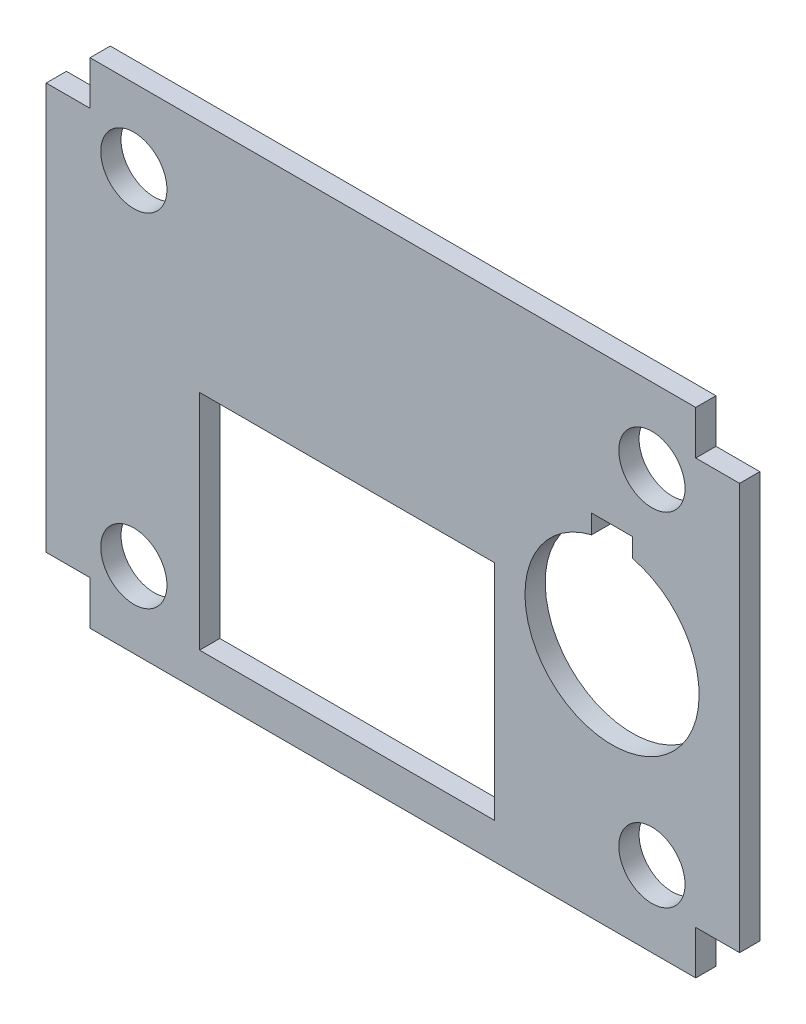
ISO-10303-21;
HEADER;
FILE_DESCRIPTION(('STEP AP214'),'2;1');
FILE_NAME('part.step','',(''),(''),'','','');
FILE_SCHEMA(('AUTOMOTIVE_DESIGN { 1 0 10303 214 1 1 1 1 }'));
ENDSEC;
DATA;
#1=APPLICATION_CONTEXT('core data for automotive mechanical design processes');
#2=APPLICATION_PROTOCOL_DEFINITION('international standard','automotive_design',2000,#1);
#3=PRODUCT_CONTEXT('',#1,'mechanical');
#4=PRODUCT('Part','Part','',(#3));
#5=PRODUCT_RELATED_PRODUCT_CATEGORY('part','',(#4));
#6=PRODUCT_DEFINITION_FORMATION('','',#4);
#7=PRODUCT_DEFINITION_CONTEXT('part definition',#1,'design');
#8=PRODUCT_DEFINITION('design','',#6,#7);
#9=PRODUCT_DEFINITION_SHAPE('','',#8);
#10=(LENGTH_UNIT() NAMED_UNIT(*) SI_UNIT(.MILLI.,.METRE.));
#11=(NAMED_UNIT(*) PLANE_ANGLE_UNIT() SI_UNIT($,.RADIAN.));
#12=(NAMED_UNIT(*) SI_UNIT($,.STERADIAN.) SOLID_ANGLE_UNIT());
#13=UNCERTAINTY_MEASURE_WITH_UNIT(LENGTH_MEASURE(1.E-05),#10,'distance_accuracy_value','');
#14=(GEOMETRIC_REPRESENTATION_CONTEXT(3) GLOBAL_UNCERTAINTY_ASSIGNED_CONTEXT((#13)) GLOBAL_UNIT_ASSIGNED_CONTEXT((#10,
#11,#12)) REPRESENTATION_CONTEXT('',''));
#15=CARTESIAN_POINT('',(0.,0.,0.));
#16=DIRECTION('',(0.,0.,1.));
#17=DIRECTION('',(1.,0.,0.));
#18=AXIS2_PLACEMENT_3D('',#15,#16,#17);
#19=CARTESIAN_POINT('',(-20.5105,14.1605,1.29032));
#20=DIRECTION('',(0.,0.,1.));
#21=DIRECTION('',(1.,0.,0.));
#22=AXIS2_PLACEMENT_3D('',#19,#20,#21);
#23=PLANE('',#22);
#24=DIRECTION('',(0.,1.,0.));
#25=VECTOR('',#24,1.);
#26=CARTESIAN_POINT('',(12.67,14.1605,1.29032));
#27=LINE('',#26,#25);
#28=CARTESIAN_POINT('',(12.67,5.39560005930758,1.29032));
#29=VERTEX_POINT('',#28);
#30=CARTESIAN_POINT('',(12.67,6.6,1.29032));
#31=VERTEX_POINT('',#30);
#32=EDGE_CURVE('E46',#29,#31,#27,.T.);
#33=ORIENTED_EDGE('',*,*,#32,.T.);
#34=DIRECTION('',(1.,0.,0.));
#35=VECTOR('',#34,1.);
#36=CARTESIAN_POINT('',(12.67,6.6,1.29032));
#37=LINE('',#36,#35);
#38=CARTESIAN_POINT('',(15.27,6.6,1.29032));
#39=VERTEX_POINT('',#38);
#40=EDGE_CURVE('E171',#31,#39,#37,.T.);
#41=ORIENTED_EDGE('',*,*,#40,.T.);
#42=DIRECTION('',(0.,1.,0.));
#43=VECTOR('',#42,1.);
#44=CARTESIAN_POINT('',(15.27,5.39560005930758,1.29032));
#45=LINE('',#44,#43);
#46=CARTESIAN_POINT('',(15.27,5.39560005930758,1.29032));
#47=VERTEX_POINT('',#46);
#48=EDGE_CURVE('E58',#39,#47,#45,.F.);
#49=ORIENTED_EDGE('',*,*,#48,.T.);
#50=CARTESIAN_POINT('',(13.97,0.,1.29032));
#51=DIRECTION('',(0.,0.,1.));
#52=DIRECTION('',(1.,0.,0.));
#53=AXIS2_PLACEMENT_3D('',#50,#51,#52);
#54=CIRCLE('',#53,5.55);
#55=EDGE_CURVE('E51',#47,#29,#54,.F.);
#56=ORIENTED_EDGE('',*,*,#55,.T.);
#57=EDGE_LOOP('',(#33,#41,#49,#56));
#58=FACE_BOUND('',#57,.T.);
#59=DIRECTION('',(0.,1.,0.));
#60=VECTOR('',#59,1.);
#61=CARTESIAN_POINT('',(-12.319,0.762000000000001,1.29032));
#62=LINE('',#61,#60);
#63=CARTESIAN_POINT('',(-12.319,-13.462,1.29032));
#64=VERTEX_POINT('',#63);
#65=CARTESIAN_POINT('',(-12.319,0.762000000000001,1.29032));
#66=VERTEX_POINT('',#65);
#67=EDGE_CURVE('E167',#64,#66,#62,.T.);
#68=ORIENTED_EDGE('',*,*,#67,.T.);
#69=DIRECTION('',(1.,0.,0.));
#70=VECTOR('',#69,1.);
#71=CARTESIAN_POINT('',(-12.319,0.762000000000001,1.29032));
#72=LINE('',#71,#70);
#73=CARTESIAN_POINT('',(6.477,0.762000000000001,1.29032));
#74=VERTEX_POINT('',#73);
#75=EDGE_CURVE('E263',#66,#74,#72,.T.);
#76=ORIENTED_EDGE('',*,*,#75,.T.);
#77=DIRECTION('',(0.,1.,0.));
#78=VECTOR('',#77,1.);
#79=CARTESIAN_POINT('',(6.477,0.762000000000001,1.29032));
#80=LINE('',#79,#78);
#81=CARTESIAN_POINT('',(6.477,-13.462,1.29032));
#82=VERTEX_POINT('',#81);
#83=EDGE_CURVE('E260',#74,#82,#80,.F.);
#84=ORIENTED_EDGE('',*,*,#83,.T.);
#85=DIRECTION('',(1.,0.,0.));
#86=VECTOR('',#85,1.);
#87=CARTESIAN_POINT('',(-12.319,-13.462,1.29032));
#88=LINE('',#87,#86);
#89=EDGE_CURVE('E255',#82,#64,#88,.F.);
#90=ORIENTED_EDGE('',*,*,#89,.T.);
#91=EDGE_LOOP('',(#68,#76,#84,#90));
#92=FACE_BOUND('',#91,.T.);
#93=CARTESIAN_POINT('',(-16.51,-10.922,1.29032));
#94=DIRECTION('',(0.,0.,1.));
#95=DIRECTION('',(1.,0.,0.));
#96=AXIS2_PLACEMENT_3D('',#93,#94,#95);
#97=CIRCLE('',#96,2.11);
#98=CARTESIAN_POINT('',(-14.4,-10.922,1.29032));
#99=VERTEX_POINT('',#98);
#100=EDGE_CURVE('E266',#99,#99,#97,.F.);
#101=ORIENTED_EDGE('',*,*,#100,.T.);
#102=EDGE_LOOP('',(#101));
#103=FACE_BOUND('',#102,.T.);
#104=CARTESIAN_POINT('',(16.51,-10.922,1.29032));
#105=DIRECTION('',(0.,0.,1.));
#106=DIRECTION('',(1.,0.,0.));
#107=AXIS2_PLACEMENT_3D('',#104,#105,#106);
#108=CIRCLE('',#107,2.11);
#109=CARTESIAN_POINT('',(18.62,-10.922,1.29032));
#110=VERTEX_POINT('',#109);
#111=EDGE_CURVE('E360',#110,#110,#108,.F.);
#112=ORIENTED_EDGE('',*,*,#111,.T.);
#113=EDGE_LOOP('',(#112));
#114=FACE_BOUND('',#113,.T.);
#115=CARTESIAN_POINT('',(16.51,10.922,1.29032));
#116=DIRECTION('',(0.,0.,1.));
#117=DIRECTION('',(1.,0.,0.));
#118=AXIS2_PLACEMENT_3D('',#115,#116,#117);
#119=CIRCLE('',#118,2.11);
#120=CARTESIAN_POINT('',(18.62,10.922,1.29032));
#121=VERTEX_POINT('',#120);
#122=EDGE_CURVE('E362',#121,#121,#119,.F.);
#123=ORIENTED_EDGE('',*,*,#122,.T.);
#124=EDGE_LOOP('',(#123));
#125=FACE_BOUND('',#124,.T.);
#126=CARTESIAN_POINT('',(-16.51,10.922,1.29032));
#127=DIRECTION('',(0.,0.,1.));
#128=DIRECTION('',(1.,0.,0.));
#129=AXIS2_PLACEMENT_3D('',#126,#127,#128);
#130=CIRCLE('',#129,2.11);
#131=CARTESIAN_POINT('',(-14.4,10.922,1.29032));
#132=VERTEX_POINT('',#131);
#133=EDGE_CURVE('E20',#132,#132,#130,.F.);
#134=ORIENTED_EDGE('',*,*,#133,.T.);
#135=EDGE_LOOP('',(#134));
#136=FACE_BOUND('',#135,.T.);
#137=DIRECTION('',(0.,1.,0.));
#138=VECTOR('',#137,1.);
#139=CARTESIAN_POINT('',(-22.098,14.1605,1.29032));
#140=LINE('',#139,#138);
#141=CARTESIAN_POINT('',(-22.098,12.954,1.29032));
#142=VERTEX_POINT('',#141);
#143=CARTESIAN_POINT('',(-22.098,-12.954,1.29032));
#144=VERTEX_POINT('',#143);
#145=EDGE_CURVE('E293',#142,#144,#140,.F.);
#146=ORIENTED_EDGE('',*,*,#145,.T.);
#147=DIRECTION('',(1.,0.,0.));
#148=VECTOR('',#147,1.);
#149=CARTESIAN_POINT('',(-22.098,-12.954,1.29032));
#150=LINE('',#149,#148);
#151=CARTESIAN_POINT('',(-19.304,-12.954,1.29032));
#152=VERTEX_POINT('',#151);
#153=EDGE_CURVE('E290',#144,#152,#150,.T.);
#154=ORIENTED_EDGE('',*,*,#153,.T.);
#155=DIRECTION('',(0.,1.,0.));
#156=VECTOR('',#155,1.);
#157=CARTESIAN_POINT('',(-19.304,-15.748,1.29032));
#158=LINE('',#157,#156);
#159=CARTESIAN_POINT('',(-19.304,-15.748,1.29032));
#160=VERTEX_POINT('',#159);
#161=EDGE_CURVE('E285',#152,#160,#158,.F.);
#162=ORIENTED_EDGE('',*,*,#161,.T.);
#163=DIRECTION('',(1.,0.,0.));
#164=VECTOR('',#163,1.);
#165=CARTESIAN_POINT('',(-20.5105,-15.748,1.29032));
#166=LINE('',#165,#164);
#167=CARTESIAN_POINT('',(19.304,-15.748,1.29032));
#168=VERTEX_POINT('',#167);
#169=EDGE_CURVE('E276',#160,#168,#166,.T.);
#170=ORIENTED_EDGE('',*,*,#169,.T.);
#171=DIRECTION('',(0.,1.,0.));
#172=VECTOR('',#171,1.);
#173=CARTESIAN_POINT('',(19.304,-15.748,1.29032));
#174=LINE('',#173,#172);
#175=CARTESIAN_POINT('',(19.304,-12.954,1.29032));
#176=VERTEX_POINT('',#175);
#177=EDGE_CURVE('E273',#168,#176,#174,.T.);
#178=ORIENTED_EDGE('',*,*,#177,.T.);
#179=DIRECTION('',(1.,0.,0.));
#180=VECTOR('',#179,1.);
#181=CARTESIAN_POINT('',(22.098,-12.954,1.29032));
#182=LINE('',#181,#180);
#183=CARTESIAN_POINT('',(22.098,-12.954,1.29032));
#184=VERTEX_POINT('',#183);
#185=EDGE_CURVE('E334',#176,#184,#182,.T.);
#186=ORIENTED_EDGE('',*,*,#185,.T.);
#187=DIRECTION('',(0.,-1.,0.));
#188=VECTOR('',#187,1.);
#189=CARTESIAN_POINT('',(22.098,14.1605,1.29032));
#190=LINE('',#189,#188);
#191=CARTESIAN_POINT('',(22.098,12.954,1.29032));
#192=VERTEX_POINT('',#191);
#193=EDGE_CURVE('E331',#184,#192,#190,.F.);
#194=ORIENTED_EDGE('',*,*,#193,.T.);
#195=DIRECTION('',(1.,0.,0.));
#196=VECTOR('',#195,1.);
#197=CARTESIAN_POINT('',(22.098,12.954,1.29032));
#198=LINE('',#197,#196);
#199=CARTESIAN_POINT('',(19.304,12.954,1.29032));
#200=VERTEX_POINT('',#199);
#201=EDGE_CURVE('E325',#192,#200,#198,.F.);
#202=ORIENTED_EDGE('',*,*,#201,.T.);
#203=DIRECTION('',(0.,1.,0.));
#204=VECTOR('',#203,1.);
#205=CARTESIAN_POINT('',(19.304,15.748,1.29032));
#206=LINE('',#205,#204);
#207=CARTESIAN_POINT('',(19.304,15.748,1.29032));
#208=VERTEX_POINT('',#207);
#209=EDGE_CURVE('E319',#200,#208,#206,.T.);
#210=ORIENTED_EDGE('',*,*,#209,.T.);
#211=DIRECTION('',(1.,0.,0.));
#212=VECTOR('',#211,1.);
#213=CARTESIAN_POINT('',(-20.5105,15.748,1.29032));
#214=LINE('',#213,#212);
#215=CARTESIAN_POINT('',(-19.304,15.748,1.29032));
#216=VERTEX_POINT('',#215);
#217=EDGE_CURVE('E313',#208,#216,#214,.F.);
#218=ORIENTED_EDGE('',*,*,#217,.T.);
#219=DIRECTION('',(0.,1.,0.));
#220=VECTOR('',#219,1.);
#221=CARTESIAN_POINT('',(-19.304,15.748,1.29032));
#222=LINE('',#221,#220);
#223=CARTESIAN_POINT('',(-19.304,12.954,1.29032));
#224=VERTEX_POINT('',#223);
#225=EDGE_CURVE('E307',#216,#224,#222,.F.);
#226=ORIENTED_EDGE('',*,*,#225,.T.);
#227=DIRECTION('',(1.,0.,0.));
#228=VECTOR('',#227,1.);
#229=CARTESIAN_POINT('',(-22.098,12.954,1.29032));
#230=LINE('',#229,#228);
#231=EDGE_CURVE('E302',#224,#142,#230,.F.);
#232=ORIENTED_EDGE('',*,*,#231,.T.);
#233=EDGE_LOOP('',(#146,#154,#162,#170,#178,#186,#194,#202,#210,#218,#226,#232));
#234=FACE_BOUND('',#233,.T.);
#235=ADVANCED_FACE('F17',(#58,#92,#103,#114,#125,#136,#234),#23,.T.);
#236=CARTESIAN_POINT('',(22.098,-12.954,0.));
#237=DIRECTION('',(0.,1.,0.));
#238=DIRECTION('',(0.,0.,1.));
#239=AXIS2_PLACEMENT_3D('',#236,#237,#238);
#240=PLANE('',#239);
#241=DIRECTION('',(1.,0.,0.));
#242=VECTOR('',#241,1.);
#243=CARTESIAN_POINT('',(-20.5105,-12.954,0.));
#244=LINE('',#243,#242);
#245=CARTESIAN_POINT('',(19.304,-12.954,0.));
#246=VERTEX_POINT('',#245);
#247=CARTESIAN_POINT('',(22.098,-12.954,0.));
#248=VERTEX_POINT('',#247);
#249=EDGE_CURVE('E230',#246,#248,#244,.T.);
#250=ORIENTED_EDGE('',*,*,#249,.T.);
#251=DIRECTION('',(0.,0.,1.));
#252=VECTOR('',#251,1.);
#253=CARTESIAN_POINT('',(22.098,-12.954,1.29032));
#254=LINE('',#253,#252);
#255=EDGE_CURVE('E328',#248,#184,#254,.T.);
#256=ORIENTED_EDGE('',*,*,#255,.T.);
#257=ORIENTED_EDGE('',*,*,#185,.F.);
#258=DIRECTION('',(0.,0.,1.));
#259=VECTOR('',#258,1.);
#260=CARTESIAN_POINT('',(19.304,-12.954,0.));
#261=LINE('',#260,#259);
#262=EDGE_CURVE('E270',#176,#246,#261,.F.);
#263=ORIENTED_EDGE('',*,*,#262,.T.);
#264=EDGE_LOOP('',(#250,#256,#257,#263));
#265=FACE_BOUND('',#264,.T.);
#266=ADVANCED_FACE('F416',(#265),#240,.F.);
#267=CARTESIAN_POINT('',(22.098,14.1605,1.29032));
#268=DIRECTION('',(-1.,0.,0.));
#269=DIRECTION('',(0.,-1.,0.));
#270=AXIS2_PLACEMENT_3D('',#267,#268,#269);
#271=PLANE('',#270);
#272=DIRECTION('',(0.,1.,0.));
#273=VECTOR('',#272,1.);
#274=CARTESIAN_POINT('',(22.098,14.1605,0.));
#275=LINE('',#274,#273);
#276=CARTESIAN_POINT('',(22.098,12.954,0.));
#277=VERTEX_POINT('',#276);
#278=EDGE_CURVE('E227',#248,#277,#275,.T.);
#279=ORIENTED_EDGE('',*,*,#278,.T.);
#280=DIRECTION('',(0.,0.,-1.));
#281=VECTOR('',#280,1.);
#282=CARTESIAN_POINT('',(22.098,12.954,0.));
#283=LINE('',#282,#281);
#284=EDGE_CURVE('E322',#277,#192,#283,.F.);
#285=ORIENTED_EDGE('',*,*,#284,.T.);
#286=ORIENTED_EDGE('',*,*,#193,.F.);
#287=ORIENTED_EDGE('',*,*,#255,.F.);
#288=EDGE_LOOP('',(#279,#285,#286,#287));
#289=FACE_BOUND('',#288,.T.);
#290=ADVANCED_FACE('F414',(#289),#271,.F.);
#291=CARTESIAN_POINT('',(22.098,12.954,0.));
#292=DIRECTION('',(0.,-1.,0.));
#293=DIRECTION('',(0.,0.,-1.));
#294=AXIS2_PLACEMENT_3D('',#291,#292,#293);
#295=PLANE('',#294);
#296=DIRECTION('',(1.,0.,0.));
#297=VECTOR('',#296,1.);
#298=CARTESIAN_POINT('',(-20.5105,12.954,0.));
#299=LINE('',#298,#297);
#300=CARTESIAN_POINT('',(19.304,12.954,0.));
#301=VERTEX_POINT('',#300);
#302=EDGE_CURVE('E224',#277,#301,#299,.F.);
#303=ORIENTED_EDGE('',*,*,#302,.T.);
#304=DIRECTION('',(0.,0.,1.));
#305=VECTOR('',#304,1.);
#306=CARTESIAN_POINT('',(19.304,12.954,0.));
#307=LINE('',#306,#305);
#308=EDGE_CURVE('E316',#301,#200,#307,.T.);
#309=ORIENTED_EDGE('',*,*,#308,.T.);
#310=ORIENTED_EDGE('',*,*,#201,.F.);
#311=ORIENTED_EDGE('',*,*,#284,.F.);
#312=EDGE_LOOP('',(#303,#309,#310,#311));
#313=FACE_BOUND('',#312,.T.);
#314=ADVANCED_FACE('F411',(#313),#295,.F.);
#315=CARTESIAN_POINT('',(19.304,15.748,0.));
#316=DIRECTION('',(-1.,0.,0.));
#317=DIRECTION('',(0.,0.,1.));
#318=AXIS2_PLACEMENT_3D('',#315,#316,#317);
#319=PLANE('',#318);
#320=DIRECTION('',(0.,1.,0.));
#321=VECTOR('',#320,1.);
#322=CARTESIAN_POINT('',(19.304,14.1605,0.));
#323=LINE('',#322,#321);
#324=CARTESIAN_POINT('',(19.304,15.748,0.));
#325=VERTEX_POINT('',#324);
#326=EDGE_CURVE('E221',#301,#325,#323,.T.);
#327=ORIENTED_EDGE('',*,*,#326,.T.);
#328=DIRECTION('',(0.,0.,-1.));
#329=VECTOR('',#328,1.);
#330=CARTESIAN_POINT('',(19.304,15.748,1.29032));
#331=LINE('',#330,#329);
#332=EDGE_CURVE('E310',#325,#208,#331,.F.);
#333=ORIENTED_EDGE('',*,*,#332,.T.);
#334=ORIENTED_EDGE('',*,*,#209,.F.);
#335=ORIENTED_EDGE('',*,*,#308,.F.);
#336=EDGE_LOOP('',(#327,#333,#334,#335));
#337=FACE_BOUND('',#336,.T.);
#338=ADVANCED_FACE('F409',(#337),#319,.F.);
#339=CARTESIAN_POINT('',(-20.5105,15.748,1.29032));
#340=DIRECTION('',(0.,-1.,0.));
#341=DIRECTION('',(0.,0.,-1.));
#342=AXIS2_PLACEMENT_3D('',#339,#340,#341);
#343=PLANE('',#342);
#344=DIRECTION('',(1.,0.,0.));
#345=VECTOR('',#344,1.);
#346=CARTESIAN_POINT('',(-20.5105,15.748,0.));
#347=LINE('',#346,#345);
#348=CARTESIAN_POINT('',(-19.304,15.748,0.));
#349=VERTEX_POINT('',#348);
#350=EDGE_CURVE('E218',#325,#349,#347,.F.);
#351=ORIENTED_EDGE('',*,*,#350,.T.);
#352=DIRECTION('',(0.,0.,-1.));
#353=VECTOR('',#352,1.);
#354=CARTESIAN_POINT('',(-19.304,15.748,0.));
#355=LINE('',#354,#353);
#356=EDGE_CURVE('E304',#349,#216,#355,.F.);
#357=ORIENTED_EDGE('',*,*,#356,.T.);
#358=ORIENTED_EDGE('',*,*,#217,.F.);
#359=ORIENTED_EDGE('',*,*,#332,.F.);
#360=EDGE_LOOP('',(#351,#357,#358,#359));
#361=FACE_BOUND('',#360,.T.);
#362=ADVANCED_FACE('F405',(#361),#343,.F.);
#363=CARTESIAN_POINT('',(-19.304,15.748,0.));
#364=DIRECTION('',(1.,0.,0.));
#365=DIRECTION('',(0.,0.,-1.));
#366=AXIS2_PLACEMENT_3D('',#363,#364,#365);
#367=PLANE('',#366);
#368=DIRECTION('',(0.,1.,0.));
#369=VECTOR('',#368,1.);
#370=CARTESIAN_POINT('',(-19.304,14.1605,0.));
#371=LINE('',#370,#369);
#372=CARTESIAN_POINT('',(-19.304,12.954,0.));
#373=VERTEX_POINT('',#372);
#374=EDGE_CURVE('E215',#349,#373,#371,.F.);
#375=ORIENTED_EDGE('',*,*,#374,.T.);
#376=DIRECTION('',(0.,0.,-1.));
#377=VECTOR('',#376,1.);
#378=CARTESIAN_POINT('',(-19.304,12.954,0.));
#379=LINE('',#378,#377);
#380=EDGE_CURVE('E299',#373,#224,#379,.F.);
#381=ORIENTED_EDGE('',*,*,#380,.T.);
#382=ORIENTED_EDGE('',*,*,#225,.F.);
#383=ORIENTED_EDGE('',*,*,#356,.F.);
#384=EDGE_LOOP('',(#375,#381,#382,#383));
#385=FACE_BOUND('',#384,.T.);
#386=ADVANCED_FACE('F403',(#385),#367,.F.);
#387=CARTESIAN_POINT('',(-22.098,12.954,0.));
#388=DIRECTION('',(0.,-1.,0.));
#389=DIRECTION('',(0.,0.,-1.));
#390=AXIS2_PLACEMENT_3D('',#387,#388,#389);
#391=PLANE('',#390);
#392=DIRECTION('',(1.,0.,0.));
#393=VECTOR('',#392,1.);
#394=CARTESIAN_POINT('',(-20.5105,12.954,0.));
#395=LINE('',#394,#393);
#396=CARTESIAN_POINT('',(-22.098,12.954,0.));
#397=VERTEX_POINT('',#396);
#398=EDGE_CURVE('E212',#373,#397,#395,.F.);
#399=ORIENTED_EDGE('',*,*,#398,.T.);
#400=DIRECTION('',(0.,0.,-1.));
#401=VECTOR('',#400,1.);
#402=CARTESIAN_POINT('',(-22.098,12.954,1.29032));
#403=LINE('',#402,#401);
#404=EDGE_CURVE('E296',#397,#142,#403,.F.);
#405=ORIENTED_EDGE('',*,*,#404,.T.);
#406=ORIENTED_EDGE('',*,*,#231,.F.);
#407=ORIENTED_EDGE('',*,*,#380,.F.);
#408=EDGE_LOOP('',(#399,#405,#406,#407));
#409=FACE_BOUND('',#408,.T.);
#410=ADVANCED_FACE('F399',(#409),#391,.F.);
#411=CARTESIAN_POINT('',(-22.098,14.1605,1.29032));
#412=DIRECTION('',(1.,0.,0.));
#413=DIRECTION('',(0.,0.,-1.));
#414=AXIS2_PLACEMENT_3D('',#411,#412,#413);
#415=PLANE('',#414);
#416=ORIENTED_EDGE('',*,*,#145,.F.);
#417=ORIENTED_EDGE('',*,*,#404,.F.);
#418=DIRECTION('',(0.,1.,0.));
#419=VECTOR('',#418,1.);
#420=CARTESIAN_POINT('',(-22.098,14.1605,0.));
#421=LINE('',#420,#419);
#422=CARTESIAN_POINT('',(-22.098,-12.954,0.));
#423=VERTEX_POINT('',#422);
#424=EDGE_CURVE('E209',#397,#423,#421,.F.);
#425=ORIENTED_EDGE('',*,*,#424,.T.);
#426=DIRECTION('',(0.,0.,1.));
#427=VECTOR('',#426,1.);
#428=CARTESIAN_POINT('',(-22.098,-12.954,0.));
#429=LINE('',#428,#427);
#430=EDGE_CURVE('E287',#423,#144,#429,.T.);
#431=ORIENTED_EDGE('',*,*,#430,.T.);
#432=EDGE_LOOP('',(#416,#417,#425,#431));
#433=FACE_BOUND('',#432,.T.);
#434=ADVANCED_FACE('F397',(#433),#415,.F.);
#435=CARTESIAN_POINT('',(-22.098,-12.954,0.));
#436=DIRECTION('',(0.,1.,0.));
#437=DIRECTION('',(0.,0.,1.));
#438=AXIS2_PLACEMENT_3D('',#435,#436,#437);
#439=PLANE('',#438);
#440=DIRECTION('',(1.,0.,0.));
#441=VECTOR('',#440,1.);
#442=CARTESIAN_POINT('',(-20.5105,-12.954,0.));
#443=LINE('',#442,#441);
#444=CARTESIAN_POINT('',(-19.304,-12.954,0.));
#445=VERTEX_POINT('',#444);
#446=EDGE_CURVE('E206',#423,#445,#443,.T.);
#447=ORIENTED_EDGE('',*,*,#446,.T.);
#448=DIRECTION('',(0.,0.,-1.));
#449=VECTOR('',#448,1.);
#450=CARTESIAN_POINT('',(-19.304,-12.954,0.));
#451=LINE('',#450,#449);
#452=EDGE_CURVE('E282',#445,#152,#451,.F.);
#453=ORIENTED_EDGE('',*,*,#452,.T.);
#454=ORIENTED_EDGE('',*,*,#153,.F.);
#455=ORIENTED_EDGE('',*,*,#430,.F.);
#456=EDGE_LOOP('',(#447,#453,#454,#455));
#457=FACE_BOUND('',#456,.T.);
#458=ADVANCED_FACE('F392',(#457),#439,.F.);
#459=CARTESIAN_POINT('',(-19.304,-15.748,0.));
#460=DIRECTION('',(1.,0.,0.));
#461=DIRECTION('',(0.,0.,-1.));
#462=AXIS2_PLACEMENT_3D('',#459,#460,#461);
#463=PLANE('',#462);
#464=DIRECTION('',(0.,1.,0.));
#465=VECTOR('',#464,1.);
#466=CARTESIAN_POINT('',(-19.304,14.1605,0.));
#467=LINE('',#466,#465);
#468=CARTESIAN_POINT('',(-19.304,-15.748,0.));
#469=VERTEX_POINT('',#468);
#470=EDGE_CURVE('E203',#445,#469,#467,.F.);
#471=ORIENTED_EDGE('',*,*,#470,.T.);
#472=DIRECTION('',(0.,0.,1.));
#473=VECTOR('',#472,1.);
#474=CARTESIAN_POINT('',(-19.304,-15.748,1.29032));
#475=LINE('',#474,#473);
#476=EDGE_CURVE('E279',#469,#160,#475,.T.);
#477=ORIENTED_EDGE('',*,*,#476,.T.);
#478=ORIENTED_EDGE('',*,*,#161,.F.);
#479=ORIENTED_EDGE('',*,*,#452,.F.);
#480=EDGE_LOOP('',(#471,#477,#478,#479));
#481=FACE_BOUND('',#480,.T.);
#482=ADVANCED_FACE('F390',(#481),#463,.F.);
#483=CARTESIAN_POINT('',(-20.5105,-15.748,1.29032));
#484=DIRECTION('',(0.,1.,0.));
#485=DIRECTION('',(0.,0.,1.));
#486=AXIS2_PLACEMENT_3D('',#483,#484,#485);
#487=PLANE('',#486);
#488=ORIENTED_EDGE('',*,*,#169,.F.);
#489=ORIENTED_EDGE('',*,*,#476,.F.);
#490=DIRECTION('',(1.,0.,0.));
#491=VECTOR('',#490,1.);
#492=CARTESIAN_POINT('',(-20.5105,-15.748,0.));
#493=LINE('',#492,#491);
#494=CARTESIAN_POINT('',(19.304,-15.748,0.));
#495=VERTEX_POINT('',#494);
#496=EDGE_CURVE('E200',#469,#495,#493,.T.);
#497=ORIENTED_EDGE('',*,*,#496,.T.);
#498=DIRECTION('',(0.,0.,1.));
#499=VECTOR('',#498,1.);
#500=CARTESIAN_POINT('',(19.304,-15.748,0.));
#501=LINE('',#500,#499);
#502=EDGE_CURVE('E267',#495,#168,#501,.T.);
#503=ORIENTED_EDGE('',*,*,#502,.T.);
#504=EDGE_LOOP('',(#488,#489,#497,#503));
#505=FACE_BOUND('',#504,.T.);
#506=ADVANCED_FACE('F420',(#505),#487,.F.);
#507=CARTESIAN_POINT('',(19.304,-15.748,0.));
#508=DIRECTION('',(-1.,0.,0.));
#509=DIRECTION('',(0.,0.,1.));
#510=AXIS2_PLACEMENT_3D('',#507,#508,#509);
#511=PLANE('',#510);
#512=DIRECTION('',(0.,1.,0.));
#513=VECTOR('',#512,1.);
#514=CARTESIAN_POINT('',(19.304,14.1605,0.));
#515=LINE('',#514,#513);
#516=EDGE_CURVE('E196',#495,#246,#515,.T.);
#517=ORIENTED_EDGE('',*,*,#516,.T.);
#518=ORIENTED_EDGE('',*,*,#262,.F.);
#519=ORIENTED_EDGE('',*,*,#177,.F.);
#520=ORIENTED_EDGE('',*,*,#502,.F.);
#521=EDGE_LOOP('',(#517,#518,#519,#520));
#522=FACE_BOUND('',#521,.T.);
#523=ADVANCED_FACE('F375',(#522),#511,.F.);
#524=CARTESIAN_POINT('',(-16.51,10.922,0.));
#525=DIRECTION('',(0.,0.,1.));
#526=DIRECTION('',(1.,0.,0.));
#527=AXIS2_PLACEMENT_3D('',#524,#525,#526);
#528=CYLINDRICAL_SURFACE('',#527,2.11);
#529=ORIENTED_EDGE('',*,*,#133,.F.);
#530=EDGE_LOOP('',(#529));
#531=FACE_BOUND('',#530,.T.);
#532=CARTESIAN_POINT('',(-16.51,10.922,0.));
#533=DIRECTION('',(0.,0.,1.));
#534=DIRECTION('',(1.,0.,0.));
#535=AXIS2_PLACEMENT_3D('',#532,#533,#534);
#536=CIRCLE('',#535,2.11);
#537=CARTESIAN_POINT('',(-14.4,10.922,0.));
#538=VERTEX_POINT('',#537);
#539=EDGE_CURVE('E199',#538,#538,#536,.F.);
#540=ORIENTED_EDGE('',*,*,#539,.T.);
#541=EDGE_LOOP('',(#540));
#542=FACE_BOUND('',#541,.T.);
#543=ADVANCED_FACE('F371',(#531,#542),#528,.F.);
#544=CARTESIAN_POINT('',(16.51,10.922,0.));
#545=DIRECTION('',(0.,0.,1.));
#546=DIRECTION('',(1.,0.,0.));
#547=AXIS2_PLACEMENT_3D('',#544,#545,#546);
#548=CYLINDRICAL_SURFACE('',#547,2.11);
#549=ORIENTED_EDGE('',*,*,#122,.F.);
#550=EDGE_LOOP('',(#549));
#551=FACE_BOUND('',#550,.T.);
#552=CARTESIAN_POINT('',(16.51,10.922,0.));
#553=DIRECTION('',(0.,0.,1.));
#554=DIRECTION('',(1.,0.,0.));
#555=AXIS2_PLACEMENT_3D('',#552,#553,#554);
#556=CIRCLE('',#555,2.11);
#557=CARTESIAN_POINT('',(18.62,10.922,0.));
#558=VERTEX_POINT('',#557);
#559=EDGE_CURVE('E352',#558,#558,#556,.F.);
#560=ORIENTED_EDGE('',*,*,#559,.T.);
#561=EDGE_LOOP('',(#560));
#562=FACE_BOUND('',#561,.T.);
#563=ADVANCED_FACE('F374',(#551,#562),#548,.F.);
#564=CARTESIAN_POINT('',(16.51,-10.922,0.));
#565=DIRECTION('',(0.,0.,1.));
#566=DIRECTION('',(1.,0.,0.));
#567=AXIS2_PLACEMENT_3D('',#564,#565,#566);
#568=CYLINDRICAL_SURFACE('',#567,2.11);
#569=ORIENTED_EDGE('',*,*,#111,.F.);
#570=EDGE_LOOP('',(#569));
#571=FACE_BOUND('',#570,.T.);
#572=CARTESIAN_POINT('',(16.51,-10.922,0.));
#573=DIRECTION('',(0.,0.,1.));
#574=DIRECTION('',(1.,0.,0.));
#575=AXIS2_PLACEMENT_3D('',#572,#573,#574);
#576=CIRCLE('',#575,2.11);
#577=CARTESIAN_POINT('',(18.62,-10.922,0.));
#578=VERTEX_POINT('',#577);
#579=EDGE_CURVE('E349',#578,#578,#576,.F.);
#580=ORIENTED_EDGE('',*,*,#579,.T.);
#581=EDGE_LOOP('',(#580));
#582=FACE_BOUND('',#581,.T.);
#583=ADVANCED_FACE('F434',(#571,#582),#568,.F.);
#584=CARTESIAN_POINT('',(-16.51,-10.922,0.));
#585=DIRECTION('',(0.,0.,1.));
#586=DIRECTION('',(1.,0.,0.));
#587=AXIS2_PLACEMENT_3D('',#584,#585,#586);
#588=CYLINDRICAL_SURFACE('',#587,2.11);
#589=ORIENTED_EDGE('',*,*,#100,.F.);
#590=EDGE_LOOP('',(#589));
#591=FACE_BOUND('',#590,.T.);
#592=CARTESIAN_POINT('',(-16.51,-10.922,0.));
#593=DIRECTION('',(0.,0.,1.));
#594=DIRECTION('',(1.,0.,0.));
#595=AXIS2_PLACEMENT_3D('',#592,#593,#594);
#596=CIRCLE('',#595,2.11);
#597=CARTESIAN_POINT('',(-14.4,-10.922,0.));
#598=VERTEX_POINT('',#597);
#599=EDGE_CURVE('E195',#598,#598,#596,.F.);
#600=ORIENTED_EDGE('',*,*,#599,.T.);
#601=EDGE_LOOP('',(#600));
#602=FACE_BOUND('',#601,.T.);
#603=ADVANCED_FACE('F437',(#591,#602),#588,.F.);
#604=CARTESIAN_POINT('',(-12.319,0.762000000000001,0.));
#605=DIRECTION('',(0.,1.,0.));
#606=DIRECTION('',(0.,0.,1.));
#607=AXIS2_PLACEMENT_3D('',#604,#605,#606);
#608=PLANE('',#607);
#609=DIRECTION('',(1.,0.,0.));
#610=VECTOR('',#609,1.);
#611=CARTESIAN_POINT('',(-20.5105,0.762000000000001,0.));
#612=LINE('',#611,#610);
#613=CARTESIAN_POINT('',(-12.319,0.762000000000001,0.));
#614=VERTEX_POINT('',#613);
#615=CARTESIAN_POINT('',(6.477,0.762000000000001,0.));
#616=VERTEX_POINT('',#615);
#617=EDGE_CURVE('E182',#614,#616,#612,.T.);
#618=ORIENTED_EDGE('',*,*,#617,.T.);
#619=DIRECTION('',(0.,0.,1.));
#620=VECTOR('',#619,1.);
#621=CARTESIAN_POINT('',(6.477,0.762000000000001,0.));
#622=LINE('',#621,#620);
#623=EDGE_CURVE('E257',#616,#74,#622,.T.);
#624=ORIENTED_EDGE('',*,*,#623,.T.);
#625=ORIENTED_EDGE('',*,*,#75,.F.);
#626=DIRECTION('',(0.,0.,1.));
#627=VECTOR('',#626,1.);
#628=CARTESIAN_POINT('',(-12.319,0.762000000000001,0.));
#629=LINE('',#628,#627);
#630=EDGE_CURVE('E172',#66,#614,#629,.F.);
#631=ORIENTED_EDGE('',*,*,#630,.T.);
#632=EDGE_LOOP('',(#618,#624,#625,#631));
#633=FACE_BOUND('',#632,.T.);
#634=ADVANCED_FACE('F544',(#633),#608,.F.);
#635=CARTESIAN_POINT('',(6.477,0.762000000000001,0.));
#636=DIRECTION('',(1.,0.,0.));
#637=DIRECTION('',(0.,1.,0.));
#638=AXIS2_PLACEMENT_3D('',#635,#636,#637);
#639=PLANE('',#638);
#640=DIRECTION('',(0.,1.,0.));
#641=VECTOR('',#640,1.);
#642=CARTESIAN_POINT('',(6.477,14.1605,0.));
#643=LINE('',#642,#641);
#644=CARTESIAN_POINT('',(6.477,-13.462,0.));
#645=VERTEX_POINT('',#644);
#646=EDGE_CURVE('E189',#616,#645,#643,.F.);
#647=ORIENTED_EDGE('',*,*,#646,.T.);
#648=DIRECTION('',(0.,0.,1.));
#649=VECTOR('',#648,1.);
#650=CARTESIAN_POINT('',(6.477,-13.462,0.));
#651=LINE('',#650,#649);
#652=EDGE_CURVE('E188',#645,#82,#651,.T.);
#653=ORIENTED_EDGE('',*,*,#652,.T.);
#654=ORIENTED_EDGE('',*,*,#83,.F.);
#655=ORIENTED_EDGE('',*,*,#623,.F.);
#656=EDGE_LOOP('',(#647,#653,#654,#655));
#657=FACE_BOUND('',#656,.T.);
#658=ADVANCED_FACE('F553',(#657),#639,.F.);
#659=CARTESIAN_POINT('',(-12.319,-13.462,0.));
#660=DIRECTION('',(0.,-1.,0.));
#661=DIRECTION('',(1.,0.,0.));
#662=AXIS2_PLACEMENT_3D('',#659,#660,#661);
#663=PLANE('',#662);
#664=DIRECTION('',(1.,0.,0.));
#665=VECTOR('',#664,1.);
#666=CARTESIAN_POINT('',(-20.5105,-13.462,0.));
#667=LINE('',#666,#665);
#668=CARTESIAN_POINT('',(-12.319,-13.462,0.));
#669=VERTEX_POINT('',#668);
#670=EDGE_CURVE('E179',#645,#669,#667,.F.);
#671=ORIENTED_EDGE('',*,*,#670,.T.);
#672=DIRECTION('',(0.,0.,1.));
#673=VECTOR('',#672,1.);
#674=CARTESIAN_POINT('',(-12.319,-13.462,0.));
#675=LINE('',#674,#673);
#676=EDGE_CURVE('E161',#669,#64,#675,.T.);
#677=ORIENTED_EDGE('',*,*,#676,.T.);
#678=ORIENTED_EDGE('',*,*,#89,.F.);
#679=ORIENTED_EDGE('',*,*,#652,.F.);
#680=EDGE_LOOP('',(#671,#677,#678,#679));
#681=FACE_BOUND('',#680,.T.);
#682=ADVANCED_FACE('F186',(#681),#663,.F.);
#683=CARTESIAN_POINT('',(-12.319,0.762000000000001,0.));
#684=DIRECTION('',(-1.,0.,0.));
#685=DIRECTION('',(0.,0.,1.));
#686=AXIS2_PLACEMENT_3D('',#683,#684,#685);
#687=PLANE('',#686);
#688=DIRECTION('',(0.,1.,0.));
#689=VECTOR('',#688,1.);
#690=CARTESIAN_POINT('',(-12.319,14.1605,0.));
#691=LINE('',#690,#689);
#692=EDGE_CURVE('E165',#669,#614,#691,.T.);
#693=ORIENTED_EDGE('',*,*,#692,.T.);
#694=ORIENTED_EDGE('',*,*,#630,.F.);
#695=ORIENTED_EDGE('',*,*,#67,.F.);
#696=ORIENTED_EDGE('',*,*,#676,.F.);
#697=EDGE_LOOP('',(#693,#694,#695,#696));
#698=FACE_BOUND('',#697,.T.);
#699=ADVANCED_FACE('F163',(#698),#687,.F.);
#700=CARTESIAN_POINT('',(12.67,6.6,0.));
#701=DIRECTION('',(0.,1.,0.));
#702=DIRECTION('',(0.,0.,1.));
#703=AXIS2_PLACEMENT_3D('',#700,#701,#702);
#704=PLANE('',#703);
#705=DIRECTION('',(1.,0.,0.));
#706=VECTOR('',#705,1.);
#707=CARTESIAN_POINT('',(-20.5105,6.6,0.));
#708=LINE('',#707,#706);
#709=CARTESIAN_POINT('',(12.67,6.6,0.));
#710=VERTEX_POINT('',#709);
#711=CARTESIAN_POINT('',(15.27,6.6,0.));
#712=VERTEX_POINT('',#711);
#713=EDGE_CURVE('E184',#710,#712,#708,.T.);
#714=ORIENTED_EDGE('',*,*,#713,.T.);
#715=DIRECTION('',(0.,0.,-1.));
#716=VECTOR('',#715,1.);
#717=CARTESIAN_POINT('',(15.27,6.6,0.));
#718=LINE('',#717,#716);
#719=EDGE_CURVE('E247',#712,#39,#718,.F.);
#720=ORIENTED_EDGE('',*,*,#719,.T.);
#721=ORIENTED_EDGE('',*,*,#40,.F.);
#722=DIRECTION('',(0.,0.,1.));
#723=VECTOR('',#722,1.);
#724=CARTESIAN_POINT('',(12.67,6.6,0.));
#725=LINE('',#724,#723);
#726=EDGE_CURVE('E235',#31,#710,#725,.F.);
#727=ORIENTED_EDGE('',*,*,#726,.T.);
#728=EDGE_LOOP('',(#714,#720,#721,#727));
#729=FACE_BOUND('',#728,.T.);
#730=ADVANCED_FACE('F580',(#729),#704,.F.);
#731=CARTESIAN_POINT('',(15.27,5.39560005930758,0.));
#732=DIRECTION('',(1.,0.,0.));
#733=DIRECTION('',(0.,0.,-1.));
#734=AXIS2_PLACEMENT_3D('',#731,#732,#733);
#735=PLANE('',#734);
#736=DIRECTION('',(0.,1.,0.));
#737=VECTOR('',#736,1.);
#738=CARTESIAN_POINT('',(15.27,14.1605,0.));
#739=LINE('',#738,#737);
#740=CARTESIAN_POINT('',(15.27,5.39560005930758,0.));
#741=VERTEX_POINT('',#740);
#742=EDGE_CURVE('E242',#712,#741,#739,.F.);
#743=ORIENTED_EDGE('',*,*,#742,.T.);
#744=DIRECTION('',(0.,0.,1.));
#745=VECTOR('',#744,1.);
#746=CARTESIAN_POINT('',(15.27,5.39560005930758,0.));
#747=LINE('',#746,#745);
#748=EDGE_CURVE('E245',#741,#47,#747,.T.);
#749=ORIENTED_EDGE('',*,*,#748,.T.);
#750=ORIENTED_EDGE('',*,*,#48,.F.);
#751=ORIENTED_EDGE('',*,*,#719,.F.);
#752=EDGE_LOOP('',(#743,#749,#750,#751));
#753=FACE_BOUND('',#752,.T.);
#754=ADVANCED_FACE('F589',(#753),#735,.F.);
#755=CARTESIAN_POINT('',(13.97,0.,0.));
#756=DIRECTION('',(0.,0.,1.));
#757=DIRECTION('',(1.,0.,0.));
#758=AXIS2_PLACEMENT_3D('',#755,#756,#757);
#759=CYLINDRICAL_SURFACE('',#758,5.55);
#760=CARTESIAN_POINT('',(13.97,0.,0.));
#761=DIRECTION('',(0.,0.,1.));
#762=DIRECTION('',(1.,0.,0.));
#763=AXIS2_PLACEMENT_3D('',#760,#761,#762);
#764=CIRCLE('',#763,5.55);
#765=CARTESIAN_POINT('',(12.67,5.39560005930758,0.));
#766=VERTEX_POINT('',#765);
#767=EDGE_CURVE('E26',#741,#766,#764,.F.);
#768=ORIENTED_EDGE('',*,*,#767,.T.);
#769=DIRECTION('',(0.,0.,1.));
#770=VECTOR('',#769,1.);
#771=CARTESIAN_POINT('',(12.67,5.39560005930758,0.));
#772=LINE('',#771,#770);
#773=EDGE_CURVE('E233',#766,#29,#772,.T.);
#774=ORIENTED_EDGE('',*,*,#773,.T.);
#775=ORIENTED_EDGE('',*,*,#55,.F.);
#776=ORIENTED_EDGE('',*,*,#748,.F.);
#777=EDGE_LOOP('',(#768,#774,#775,#776));
#778=FACE_BOUND('',#777,.T.);
#779=ADVANCED_FACE('F599',(#778),#759,.F.);
#780=CARTESIAN_POINT('',(12.67,5.39560005930758,0.));
#781=DIRECTION('',(-1.,0.,0.));
#782=DIRECTION('',(0.,0.,1.));
#783=AXIS2_PLACEMENT_3D('',#780,#781,#782);
#784=PLANE('',#783);
#785=DIRECTION('',(0.,1.,0.));
#786=VECTOR('',#785,1.);
#787=CARTESIAN_POINT('',(12.67,14.1605,0.));
#788=LINE('',#787,#786);
#789=EDGE_CURVE('E11',#766,#710,#788,.T.);
#790=ORIENTED_EDGE('',*,*,#789,.T.);
#791=ORIENTED_EDGE('',*,*,#726,.F.);
#792=ORIENTED_EDGE('',*,*,#32,.F.);
#793=ORIENTED_EDGE('',*,*,#773,.F.);
#794=EDGE_LOOP('',(#790,#791,#792,#793));
#795=FACE_BOUND('',#794,.T.);
#796=ADVANCED_FACE('F381',(#795),#784,.F.);
#797=CARTESIAN_POINT('',(-20.5105,14.1605,0.));
#798=DIRECTION('',(0.,0.,1.));
#799=DIRECTION('',(1.,0.,0.));
#800=AXIS2_PLACEMENT_3D('',#797,#798,#799);
#801=PLANE('',#800);
#802=ORIENTED_EDGE('',*,*,#789,.F.);
#803=ORIENTED_EDGE('',*,*,#767,.F.);
#804=ORIENTED_EDGE('',*,*,#742,.F.);
#805=ORIENTED_EDGE('',*,*,#713,.F.);
#806=EDGE_LOOP('',(#802,#803,#804,#805));
#807=FACE_BOUND('',#806,.T.);
#808=ORIENTED_EDGE('',*,*,#670,.F.);
#809=ORIENTED_EDGE('',*,*,#646,.F.);
#810=ORIENTED_EDGE('',*,*,#617,.F.);
#811=ORIENTED_EDGE('',*,*,#692,.F.);
#812=EDGE_LOOP('',(#808,#809,#810,#811));
#813=FACE_BOUND('',#812,.T.);
#814=ORIENTED_EDGE('',*,*,#599,.F.);
#815=EDGE_LOOP('',(#814));
#816=FACE_BOUND('',#815,.T.);
#817=ORIENTED_EDGE('',*,*,#579,.F.);
#818=EDGE_LOOP('',(#817));
#819=FACE_BOUND('',#818,.T.);
#820=ORIENTED_EDGE('',*,*,#559,.F.);
#821=EDGE_LOOP('',(#820));
#822=FACE_BOUND('',#821,.T.);
#823=ORIENTED_EDGE('',*,*,#539,.F.);
#824=EDGE_LOOP('',(#823));
#825=FACE_BOUND('',#824,.T.);
#826=ORIENTED_EDGE('',*,*,#496,.F.);
#827=ORIENTED_EDGE('',*,*,#470,.F.);
#828=ORIENTED_EDGE('',*,*,#446,.F.);
#829=ORIENTED_EDGE('',*,*,#424,.F.);
#830=ORIENTED_EDGE('',*,*,#398,.F.);
#831=ORIENTED_EDGE('',*,*,#374,.F.);
#832=ORIENTED_EDGE('',*,*,#350,.F.);
#833=ORIENTED_EDGE('',*,*,#326,.F.);
#834=ORIENTED_EDGE('',*,*,#302,.F.);
#835=ORIENTED_EDGE('',*,*,#278,.F.);
#836=ORIENTED_EDGE('',*,*,#249,.F.);
#837=ORIENTED_EDGE('',*,*,#516,.F.);
#838=EDGE_LOOP('',(#826,#827,#828,#829,#830,#831,#832,#833,#834,#835,#836,#837));
#839=FACE_BOUND('',#838,.T.);
#840=ADVANCED_FACE('F176',(#807,#813,#816,#819,#822,#825,#839),#801,.F.);
#841=CLOSED_SHELL('',(#235,#266,#290,#314,#338,#362,#386,#410,#434,#458,#482,#506,#523,#543,
#563,#583,#603,#634,#658,#682,#699,#730,#754,#779,#796,#840));
#842=MANIFOLD_SOLID_BREP('B1',#841);
#843=ADVANCED_BREP_SHAPE_REPRESENTATION('',(#18,#842),#14);
#844=SHAPE_DEFINITION_REPRESENTATION(#9,#843);
ENDSEC;
END-ISO-10303-21;
